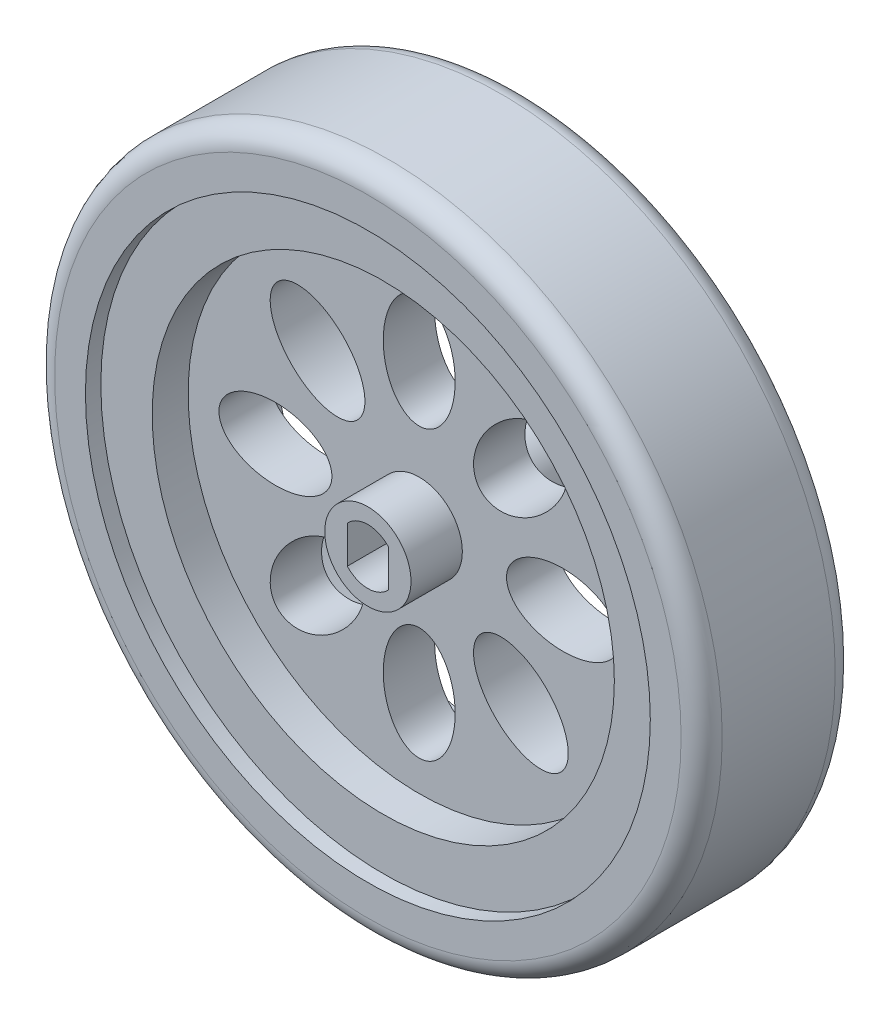
ISO-10303-21;
HEADER;
FILE_DESCRIPTION(('STEP AP214'),'2;1');
FILE_NAME('part.step','',(''),(''),'','','');
FILE_SCHEMA(('AUTOMOTIVE_DESIGN { 1 0 10303 214 1 1 1 1 }'));
ENDSEC;
DATA;
#1=APPLICATION_CONTEXT('core data for automotive mechanical design processes');
#2=APPLICATION_PROTOCOL_DEFINITION('international standard','automotive_design',2000,#1);
#3=PRODUCT_CONTEXT('',#1,'mechanical');
#4=PRODUCT('Part','Part','',(#3));
#5=PRODUCT_RELATED_PRODUCT_CATEGORY('part','',(#4));
#6=PRODUCT_DEFINITION_FORMATION('','',#4);
#7=PRODUCT_DEFINITION_CONTEXT('part definition',#1,'design');
#8=PRODUCT_DEFINITION('design','',#6,#7);
#9=PRODUCT_DEFINITION_SHAPE('','',#8);
#10=(LENGTH_UNIT() NAMED_UNIT(*) SI_UNIT(.MILLI.,.METRE.));
#11=(NAMED_UNIT(*) PLANE_ANGLE_UNIT() SI_UNIT($,.RADIAN.));
#12=(NAMED_UNIT(*) SI_UNIT($,.STERADIAN.) SOLID_ANGLE_UNIT());
#13=UNCERTAINTY_MEASURE_WITH_UNIT(LENGTH_MEASURE(1.E-05),#10,'distance_accuracy_value','');
#14=(GEOMETRIC_REPRESENTATION_CONTEXT(3) GLOBAL_UNCERTAINTY_ASSIGNED_CONTEXT((#13)) GLOBAL_UNIT_ASSIGNED_CONTEXT((#10,
#11,#12)) REPRESENTATION_CONTEXT('',''));
#15=CARTESIAN_POINT('',(0.,0.,0.));
#16=DIRECTION('',(0.,0.,1.));
#17=DIRECTION('',(1.,0.,0.));
#18=AXIS2_PLACEMENT_3D('',#15,#16,#17);
#19=CARTESIAN_POINT('',(0.,0.,-27.079393923934));
#20=DIRECTION('',(0.,0.,1.));
#21=DIRECTION('',(1.,0.,0.));
#22=AXIS2_PLACEMENT_3D('',#19,#20,#21);
#23=CYLINDRICAL_SURFACE('',#22,4.2);
#24=CARTESIAN_POINT('',(0.,0.,-11.35));
#25=DIRECTION('',(0.,0.,1.));
#26=DIRECTION('',(1.,0.,0.));
#27=AXIS2_PLACEMENT_3D('',#24,#25,#26);
#28=CIRCLE('',#27,4.2);
#29=CARTESIAN_POINT('',(4.2,0.,-11.35));
#30=VERTEX_POINT('',#29);
#31=EDGE_CURVE('E51',#30,#30,#28,.F.);
#32=ORIENTED_EDGE('',*,*,#31,.F.);
#33=EDGE_LOOP('',(#32));
#34=FACE_BOUND('',#33,.T.);
#35=CARTESIAN_POINT('',(0.,0.,-2.5));
#36=DIRECTION('',(0.,0.,1.));
#37=DIRECTION('',(1.,0.,0.));
#38=AXIS2_PLACEMENT_3D('',#35,#36,#37);
#39=CIRCLE('',#38,4.2);
#40=CARTESIAN_POINT('',(4.2,0.,-2.5));
#41=VERTEX_POINT('',#40);
#42=EDGE_CURVE('E142',#41,#41,#39,.T.);
#43=ORIENTED_EDGE('',*,*,#42,.F.);
#44=EDGE_LOOP('',(#43));
#45=FACE_BOUND('',#44,.T.);
#46=ADVANCED_FACE('F41',(#34,#45),#23,.T.);
#47=CARTESIAN_POINT('',(0.,0.,2.5));
#48=DIRECTION('',(0.,0.,1.));
#49=DIRECTION('',(1.,0.,0.));
#50=AXIS2_PLACEMENT_3D('',#47,#48,#49);
#51=CIRCLE('',#50,4.2);
#52=CARTESIAN_POINT('',(4.2,0.,2.5));
#53=VERTEX_POINT('',#52);
#54=EDGE_CURVE('E11',#53,#53,#51,.F.);
#55=ORIENTED_EDGE('',*,*,#54,.F.);
#56=EDGE_LOOP('',(#55));
#57=FACE_BOUND('',#56,.T.);
#58=CARTESIAN_POINT('',(0.,0.,7.5));
#59=DIRECTION('',(0.,0.,1.));
#60=DIRECTION('',(1.,0.,0.));
#61=AXIS2_PLACEMENT_3D('',#58,#59,#60);
#62=CIRCLE('',#61,4.2);
#63=CARTESIAN_POINT('',(4.2,0.,7.5));
#64=VERTEX_POINT('',#63);
#65=EDGE_CURVE('E116',#64,#64,#62,.T.);
#66=ORIENTED_EDGE('',*,*,#65,.F.);
#67=EDGE_LOOP('',(#66));
#68=FACE_BOUND('',#67,.T.);
#69=ADVANCED_FACE('F43',(#57,#68),#23,.T.);
#70=CARTESIAN_POINT('',(0.,0.,7.5));
#71=DIRECTION('',(0.,0.,1.));
#72=DIRECTION('',(1.,0.,0.));
#73=AXIS2_PLACEMENT_3D('',#70,#71,#72);
#74=PLANE('',#73);
#75=CARTESIAN_POINT('',(0.,0.,7.5));
#76=DIRECTION('',(0.,0.,1.));
#77=DIRECTION('',(1.,0.,0.));
#78=AXIS2_PLACEMENT_3D('',#75,#76,#77);
#79=CIRCLE('',#78,2.7);
#80=CARTESIAN_POINT('',(2.,1.81383571472171,7.5));
#81=VERTEX_POINT('',#80);
#82=CARTESIAN_POINT('',(-2.,1.81383571472171,7.5));
#83=VERTEX_POINT('',#82);
#84=EDGE_CURVE('E101',#81,#83,#79,.T.);
#85=ORIENTED_EDGE('',*,*,#84,.F.);
#86=DIRECTION('',(0.,1.,0.));
#87=VECTOR('',#86,1.);
#88=CARTESIAN_POINT('',(2.,1.81383571472171,7.5));
#89=LINE('',#88,#87);
#90=CARTESIAN_POINT('',(2.,-1.81383571472171,7.5));
#91=VERTEX_POINT('',#90);
#92=EDGE_CURVE('E106',#91,#81,#89,.T.);
#93=ORIENTED_EDGE('',*,*,#92,.F.);
#94=CARTESIAN_POINT('',(0.,0.,7.5));
#95=DIRECTION('',(0.,0.,1.));
#96=DIRECTION('',(1.,0.,0.));
#97=AXIS2_PLACEMENT_3D('',#94,#95,#96);
#98=CIRCLE('',#97,2.7);
#99=CARTESIAN_POINT('',(-2.,-1.81383571472171,7.5));
#100=VERTEX_POINT('',#99);
#101=EDGE_CURVE('E86',#100,#91,#98,.T.);
#102=ORIENTED_EDGE('',*,*,#101,.F.);
#103=DIRECTION('',(0.,-1.,0.));
#104=VECTOR('',#103,1.);
#105=CARTESIAN_POINT('',(-2.,1.81383571472171,7.5));
#106=LINE('',#105,#104);
#107=EDGE_CURVE('E94',#83,#100,#106,.T.);
#108=ORIENTED_EDGE('',*,*,#107,.F.);
#109=EDGE_LOOP('',(#85,#93,#102,#108));
#110=FACE_BOUND('',#109,.T.);
#111=ORIENTED_EDGE('',*,*,#65,.T.);
#112=EDGE_LOOP('',(#111));
#113=FACE_BOUND('',#112,.T.);
#114=ADVANCED_FACE('F103',(#110,#113),#74,.T.);
#115=CARTESIAN_POINT('',(-2.,1.81383571472171,-27.079393923934));
#116=DIRECTION('',(-1.,0.,0.));
#117=DIRECTION('',(0.,0.,1.));
#118=AXIS2_PLACEMENT_3D('',#115,#116,#117);
#119=PLANE('',#118);
#120=DIRECTION('',(0.,0.,1.));
#121=VECTOR('',#120,1.);
#122=CARTESIAN_POINT('',(-2.,-1.81383571472171,-27.079393923934));
#123=LINE('',#122,#121);
#124=CARTESIAN_POINT('',(-2.,-1.81383571472171,-11.35));
#125=VERTEX_POINT('',#124);
#126=EDGE_CURVE('E82',#125,#100,#123,.T.);
#127=ORIENTED_EDGE('',*,*,#126,.F.);
#128=DIRECTION('',(0.,1.,0.));
#129=VECTOR('',#128,1.);
#130=CARTESIAN_POINT('',(-2.,1.81383571472171,-11.35));
#131=LINE('',#130,#129);
#132=CARTESIAN_POINT('',(-2.,1.81383571472171,-11.35));
#133=VERTEX_POINT('',#132);
#134=EDGE_CURVE('E58',#125,#133,#131,.T.);
#135=ORIENTED_EDGE('',*,*,#134,.T.);
#136=DIRECTION('',(0.,0.,1.));
#137=VECTOR('',#136,1.);
#138=CARTESIAN_POINT('',(-2.,1.81383571472171,-27.079393923934));
#139=LINE('',#138,#137);
#140=EDGE_CURVE('E91',#133,#83,#139,.T.);
#141=ORIENTED_EDGE('',*,*,#140,.T.);
#142=ORIENTED_EDGE('',*,*,#107,.T.);
#143=EDGE_LOOP('',(#127,#135,#141,#142));
#144=FACE_BOUND('',#143,.T.);
#145=ADVANCED_FACE('F95',(#144),#119,.F.);
#146=CARTESIAN_POINT('',(0.,0.,-27.079393923934));
#147=DIRECTION('',(0.,0.,1.));
#148=DIRECTION('',(1.,0.,0.));
#149=AXIS2_PLACEMENT_3D('',#146,#147,#148);
#150=CYLINDRICAL_SURFACE('',#149,2.7);
#151=DIRECTION('',(0.,0.,1.));
#152=VECTOR('',#151,1.);
#153=CARTESIAN_POINT('',(2.,-1.81383571472171,-27.079393923934));
#154=LINE('',#153,#152);
#155=CARTESIAN_POINT('',(2.,-1.81383571472171,-11.35));
#156=VERTEX_POINT('',#155);
#157=EDGE_CURVE('E90',#156,#91,#154,.T.);
#158=ORIENTED_EDGE('',*,*,#157,.F.);
#159=CARTESIAN_POINT('',(0.,0.,-11.35));
#160=DIRECTION('',(0.,0.,1.));
#161=DIRECTION('',(1.,0.,0.));
#162=AXIS2_PLACEMENT_3D('',#159,#160,#161);
#163=CIRCLE('',#162,2.7);
#164=EDGE_CURVE('E62',#156,#125,#163,.F.);
#165=ORIENTED_EDGE('',*,*,#164,.T.);
#166=ORIENTED_EDGE('',*,*,#126,.T.);
#167=ORIENTED_EDGE('',*,*,#101,.T.);
#168=EDGE_LOOP('',(#158,#165,#166,#167));
#169=FACE_BOUND('',#168,.T.);
#170=ADVANCED_FACE('F84',(#169),#150,.F.);
#171=CARTESIAN_POINT('',(2.,1.81383571472171,-27.079393923934));
#172=DIRECTION('',(1.,0.,0.));
#173=DIRECTION('',(0.,0.,-1.));
#174=AXIS2_PLACEMENT_3D('',#171,#172,#173);
#175=PLANE('',#174);
#176=DIRECTION('',(0.,0.,1.));
#177=VECTOR('',#176,1.);
#178=CARTESIAN_POINT('',(2.,1.81383571472171,-27.079393923934));
#179=LINE('',#178,#177);
#180=CARTESIAN_POINT('',(2.,1.81383571472171,-11.35));
#181=VERTEX_POINT('',#180);
#182=EDGE_CURVE('E113',#181,#81,#179,.T.);
#183=ORIENTED_EDGE('',*,*,#182,.F.);
#184=DIRECTION('',(0.,-1.,0.));
#185=VECTOR('',#184,1.);
#186=CARTESIAN_POINT('',(2.,1.81383571472171,-11.35));
#187=LINE('',#186,#185);
#188=EDGE_CURVE('E128',#181,#156,#187,.T.);
#189=ORIENTED_EDGE('',*,*,#188,.T.);
#190=ORIENTED_EDGE('',*,*,#157,.T.);
#191=ORIENTED_EDGE('',*,*,#92,.T.);
#192=EDGE_LOOP('',(#183,#189,#190,#191));
#193=FACE_BOUND('',#192,.T.);
#194=ADVANCED_FACE('F263',(#193),#175,.F.);
#195=CARTESIAN_POINT('',(0.,0.,-27.079393923934));
#196=DIRECTION('',(0.,0.,1.));
#197=DIRECTION('',(1.,0.,0.));
#198=AXIS2_PLACEMENT_3D('',#195,#196,#197);
#199=CYLINDRICAL_SURFACE('',#198,2.7);
#200=ORIENTED_EDGE('',*,*,#140,.F.);
#201=CARTESIAN_POINT('',(0.,0.,-11.35));
#202=DIRECTION('',(0.,0.,1.));
#203=DIRECTION('',(1.,0.,0.));
#204=AXIS2_PLACEMENT_3D('',#201,#202,#203);
#205=CIRCLE('',#204,2.7);
#206=EDGE_CURVE('E125',#133,#181,#205,.F.);
#207=ORIENTED_EDGE('',*,*,#206,.T.);
#208=ORIENTED_EDGE('',*,*,#182,.T.);
#209=ORIENTED_EDGE('',*,*,#84,.T.);
#210=EDGE_LOOP('',(#200,#207,#208,#209));
#211=FACE_BOUND('',#210,.T.);
#212=ADVANCED_FACE('F261',(#211),#199,.F.);
#213=CARTESIAN_POINT('',(0.,0.,-11.35));
#214=DIRECTION('',(0.,0.,1.));
#215=DIRECTION('',(1.,0.,0.));
#216=AXIS2_PLACEMENT_3D('',#213,#214,#215);
#217=PLANE('',#216);
#218=ORIENTED_EDGE('',*,*,#31,.T.);
#219=EDGE_LOOP('',(#218));
#220=FACE_BOUND('',#219,.T.);
#221=ORIENTED_EDGE('',*,*,#134,.F.);
#222=ORIENTED_EDGE('',*,*,#164,.F.);
#223=ORIENTED_EDGE('',*,*,#188,.F.);
#224=ORIENTED_EDGE('',*,*,#206,.F.);
#225=EDGE_LOOP('',(#221,#222,#223,#224));
#226=FACE_BOUND('',#225,.T.);
#227=ADVANCED_FACE('F254',(#220,#226),#217,.F.);
#228=CARTESIAN_POINT('',(0.,0.,2.5));
#229=DIRECTION('',(0.,0.,1.));
#230=DIRECTION('',(1.,0.,0.));
#231=AXIS2_PLACEMENT_3D('',#228,#229,#230);
#232=PLANE('',#231);
#233=CARTESIAN_POINT('',(-14.,0.,2.5));
#234=DIRECTION('',(0.,0.,1.));
#235=DIRECTION('',(-1.,0.,0.));
#236=AXIS2_PLACEMENT_3D('',#233,#234,#235);
#237=ELLIPSE('',#236,5.5,3.5);
#238=CARTESIAN_POINT('',(-19.5,0.,2.5));
#239=VERTEX_POINT('',#238);
#240=EDGE_CURVE('E474',#239,#239,#237,.T.);
#241=ORIENTED_EDGE('',*,*,#240,.F.);
#242=EDGE_LOOP('',(#241));
#243=FACE_BOUND('',#242,.T.);
#244=CARTESIAN_POINT('',(-9.89949493661161,-9.89949493661172,2.5));
#245=DIRECTION('',(0.,0.,1.));
#246=DIRECTION('',(-0.707106781186544,-0.707106781186551,0.));
#247=AXIS2_PLACEMENT_3D('',#244,#245,#246);
#248=ELLIPSE('',#247,5.5,3.5);
#249=CARTESIAN_POINT('',(-13.7885822331376,-13.7885822331378,2.5));
#250=VERTEX_POINT('',#249);
#251=EDGE_CURVE('E484',#250,#250,#248,.T.);
#252=ORIENTED_EDGE('',*,*,#251,.F.);
#253=EDGE_LOOP('',(#252));
#254=FACE_BOUND('',#253,.T.);
#255=CARTESIAN_POINT('',(0.,-14.,2.5));
#256=DIRECTION('',(0.,0.,1.));
#257=DIRECTION('',(0.,-1.,0.));
#258=AXIS2_PLACEMENT_3D('',#255,#256,#257);
#259=ELLIPSE('',#258,5.5,3.5);
#260=CARTESIAN_POINT('',(0.,-19.5,2.5));
#261=VERTEX_POINT('',#260);
#262=EDGE_CURVE('E494',#261,#261,#259,.T.);
#263=ORIENTED_EDGE('',*,*,#262,.F.);
#264=EDGE_LOOP('',(#263));
#265=FACE_BOUND('',#264,.T.);
#266=CARTESIAN_POINT('',(9.89949493661175,-9.89949493661158,2.5));
#267=DIRECTION('',(0.,0.,1.));
#268=DIRECTION('',(0.707106781186554,-0.707106781186541,0.));
#269=AXIS2_PLACEMENT_3D('',#266,#267,#268);
#270=ELLIPSE('',#269,5.5,3.5);
#271=CARTESIAN_POINT('',(13.7885822331378,-13.7885822331376,2.5));
#272=VERTEX_POINT('',#271);
#273=EDGE_CURVE('E499',#272,#272,#270,.T.);
#274=ORIENTED_EDGE('',*,*,#273,.F.);
#275=EDGE_LOOP('',(#274));
#276=FACE_BOUND('',#275,.T.);
#277=CARTESIAN_POINT('',(14.,1.46642216231412E-13,2.5));
#278=DIRECTION('',(0.,0.,1.));
#279=DIRECTION('',(1.,0.,0.));
#280=AXIS2_PLACEMENT_3D('',#277,#278,#279);
#281=ELLIPSE('',#280,5.5,3.5);
#282=CARTESIAN_POINT('',(19.5,2.04251658322323E-13,2.5));
#283=VERTEX_POINT('',#282);
#284=EDGE_CURVE('E541',#283,#283,#281,.T.);
#285=ORIENTED_EDGE('',*,*,#284,.F.);
#286=EDGE_LOOP('',(#285));
#287=FACE_BOUND('',#286,.T.);
#288=CARTESIAN_POINT('',(9.89949493661154,9.89949493661179,2.5));
#289=DIRECTION('',(0.,0.,1.));
#290=DIRECTION('',(0.707106781186539,0.707106781186556,0.));
#291=AXIS2_PLACEMENT_3D('',#288,#289,#290);
#292=ELLIPSE('',#291,5.5,3.5);
#293=CARTESIAN_POINT('',(13.7885822331375,13.7885822331378,2.5));
#294=VERTEX_POINT('',#293);
#295=EDGE_CURVE('E548',#294,#294,#292,.T.);
#296=ORIENTED_EDGE('',*,*,#295,.F.);
#297=EDGE_LOOP('',(#296));
#298=FACE_BOUND('',#297,.T.);
#299=CARTESIAN_POINT('',(-9.89949493661168,9.89949493661165,2.5));
#300=DIRECTION('',(0.,0.,1.));
#301=DIRECTION('',(-0.707106781186549,0.707106781186546,0.));
#302=AXIS2_PLACEMENT_3D('',#299,#300,#301);
#303=ELLIPSE('',#302,5.5,3.5);
#304=CARTESIAN_POINT('',(-13.7885822331377,13.7885822331377,2.5));
#305=VERTEX_POINT('',#304);
#306=EDGE_CURVE('E481',#305,#305,#303,.T.);
#307=ORIENTED_EDGE('',*,*,#306,.F.);
#308=EDGE_LOOP('',(#307));
#309=FACE_BOUND('',#308,.T.);
#310=CARTESIAN_POINT('',(0.,14.,2.5));
#311=DIRECTION('',(0.,0.,1.));
#312=DIRECTION('',(0.,1.,0.));
#313=AXIS2_PLACEMENT_3D('',#310,#311,#312);
#314=ELLIPSE('',#313,5.5,3.5);
#315=CARTESIAN_POINT('',(0.,19.5,2.5));
#316=VERTEX_POINT('',#315);
#317=EDGE_CURVE('E192',#316,#316,#314,.T.);
#318=ORIENTED_EDGE('',*,*,#317,.F.);
#319=EDGE_LOOP('',(#318));
#320=FACE_BOUND('',#319,.T.);
#321=CARTESIAN_POINT('',(0.,0.,2.5));
#322=DIRECTION('',(0.,0.,1.));
#323=DIRECTION('',(1.,0.,0.));
#324=AXIS2_PLACEMENT_3D('',#321,#322,#323);
#325=CIRCLE('',#324,22.5);
#326=CARTESIAN_POINT('',(22.5,0.,2.5));
#327=VERTEX_POINT('',#326);
#328=EDGE_CURVE('E148',#327,#327,#325,.F.);
#329=ORIENTED_EDGE('',*,*,#328,.F.);
#330=EDGE_LOOP('',(#329));
#331=FACE_BOUND('',#330,.T.);
#332=ORIENTED_EDGE('',*,*,#54,.T.);
#333=EDGE_LOOP('',(#332));
#334=FACE_BOUND('',#333,.T.);
#335=ADVANCED_FACE('F250',(#243,#254,#265,#276,#287,#298,#309,#320,#331,#334),#232,.T.);
#336=CARTESIAN_POINT('',(0.,0.,-2.5));
#337=DIRECTION('',(0.,0.,1.));
#338=DIRECTION('',(1.,0.,0.));
#339=AXIS2_PLACEMENT_3D('',#336,#337,#338);
#340=PLANE('',#339);
#341=CARTESIAN_POINT('',(-14.,0.,-2.5));
#342=DIRECTION('',(0.,0.,1.));
#343=DIRECTION('',(-1.,0.,0.));
#344=AXIS2_PLACEMENT_3D('',#341,#342,#343);
#345=ELLIPSE('',#344,5.5,3.5);
#346=CARTESIAN_POINT('',(-19.5,0.,-2.5));
#347=VERTEX_POINT('',#346);
#348=EDGE_CURVE('E477',#347,#347,#345,.T.);
#349=ORIENTED_EDGE('',*,*,#348,.T.);
#350=EDGE_LOOP('',(#349));
#351=FACE_BOUND('',#350,.T.);
#352=CARTESIAN_POINT('',(-9.89949493661161,-9.89949493661172,-2.5));
#353=DIRECTION('',(0.,0.,1.));
#354=DIRECTION('',(-0.707106781186544,-0.707106781186551,0.));
#355=AXIS2_PLACEMENT_3D('',#352,#353,#354);
#356=ELLIPSE('',#355,5.5,3.5);
#357=CARTESIAN_POINT('',(-13.7885822331376,-13.7885822331378,-2.5));
#358=VERTEX_POINT('',#357);
#359=EDGE_CURVE('E478',#358,#358,#356,.T.);
#360=ORIENTED_EDGE('',*,*,#359,.T.);
#361=EDGE_LOOP('',(#360));
#362=FACE_BOUND('',#361,.T.);
#363=CARTESIAN_POINT('',(0.,-14.,-2.5));
#364=DIRECTION('',(0.,0.,1.));
#365=DIRECTION('',(0.,-1.,0.));
#366=AXIS2_PLACEMENT_3D('',#363,#364,#365);
#367=ELLIPSE('',#366,5.5,3.5);
#368=CARTESIAN_POINT('',(0.,-19.5,-2.5));
#369=VERTEX_POINT('',#368);
#370=EDGE_CURVE('E488',#369,#369,#367,.T.);
#371=ORIENTED_EDGE('',*,*,#370,.T.);
#372=EDGE_LOOP('',(#371));
#373=FACE_BOUND('',#372,.T.);
#374=CARTESIAN_POINT('',(9.89949493661175,-9.89949493661158,-2.5));
#375=DIRECTION('',(0.,0.,1.));
#376=DIRECTION('',(0.707106781186554,-0.707106781186541,0.));
#377=AXIS2_PLACEMENT_3D('',#374,#375,#376);
#378=ELLIPSE('',#377,5.5,3.5);
#379=CARTESIAN_POINT('',(13.7885822331378,-13.7885822331376,-2.5));
#380=VERTEX_POINT('',#379);
#381=EDGE_CURVE('E503',#380,#380,#378,.T.);
#382=ORIENTED_EDGE('',*,*,#381,.T.);
#383=EDGE_LOOP('',(#382));
#384=FACE_BOUND('',#383,.T.);
#385=CARTESIAN_POINT('',(14.,1.46642216231412E-13,-2.5));
#386=DIRECTION('',(0.,0.,1.));
#387=DIRECTION('',(1.,0.,0.));
#388=AXIS2_PLACEMENT_3D('',#385,#386,#387);
#389=ELLIPSE('',#388,5.5,3.5);
#390=CARTESIAN_POINT('',(19.5,2.04251658322323E-13,-2.5));
#391=VERTEX_POINT('',#390);
#392=EDGE_CURVE('E504',#391,#391,#389,.T.);
#393=ORIENTED_EDGE('',*,*,#392,.T.);
#394=EDGE_LOOP('',(#393));
#395=FACE_BOUND('',#394,.T.);
#396=CARTESIAN_POINT('',(9.89949493661154,9.89949493661179,-2.5));
#397=DIRECTION('',(0.,0.,1.));
#398=DIRECTION('',(0.707106781186539,0.707106781186556,0.));
#399=AXIS2_PLACEMENT_3D('',#396,#397,#398);
#400=ELLIPSE('',#399,5.5,3.5);
#401=CARTESIAN_POINT('',(13.7885822331375,13.7885822331378,-2.5));
#402=VERTEX_POINT('',#401);
#403=EDGE_CURVE('E472',#402,#402,#400,.T.);
#404=ORIENTED_EDGE('',*,*,#403,.T.);
#405=EDGE_LOOP('',(#404));
#406=FACE_BOUND('',#405,.T.);
#407=CARTESIAN_POINT('',(-9.89949493661168,9.89949493661165,-2.5));
#408=DIRECTION('',(0.,0.,1.));
#409=DIRECTION('',(-0.707106781186549,0.707106781186546,0.));
#410=AXIS2_PLACEMENT_3D('',#407,#408,#409);
#411=ELLIPSE('',#410,5.5,3.5);
#412=CARTESIAN_POINT('',(-13.7885822331377,13.7885822331377,-2.5));
#413=VERTEX_POINT('',#412);
#414=EDGE_CURVE('E201',#413,#413,#411,.T.);
#415=ORIENTED_EDGE('',*,*,#414,.T.);
#416=EDGE_LOOP('',(#415));
#417=FACE_BOUND('',#416,.T.);
#418=CARTESIAN_POINT('',(0.,14.,-2.5));
#419=DIRECTION('',(0.,0.,1.));
#420=DIRECTION('',(0.,1.,0.));
#421=AXIS2_PLACEMENT_3D('',#418,#419,#420);
#422=ELLIPSE('',#421,5.5,3.5);
#423=CARTESIAN_POINT('',(0.,19.5,-2.5));
#424=VERTEX_POINT('',#423);
#425=EDGE_CURVE('E45',#424,#424,#422,.T.);
#426=ORIENTED_EDGE('',*,*,#425,.T.);
#427=EDGE_LOOP('',(#426));
#428=FACE_BOUND('',#427,.T.);
#429=CARTESIAN_POINT('',(0.,0.,-2.5));
#430=DIRECTION('',(0.,0.,1.));
#431=DIRECTION('',(1.,0.,0.));
#432=AXIS2_PLACEMENT_3D('',#429,#430,#431);
#433=CIRCLE('',#432,22.5);
#434=CARTESIAN_POINT('',(22.5,0.,-2.5));
#435=VERTEX_POINT('',#434);
#436=EDGE_CURVE('E139',#435,#435,#433,.T.);
#437=ORIENTED_EDGE('',*,*,#436,.F.);
#438=EDGE_LOOP('',(#437));
#439=FACE_BOUND('',#438,.T.);
#440=ORIENTED_EDGE('',*,*,#42,.T.);
#441=EDGE_LOOP('',(#440));
#442=FACE_BOUND('',#441,.T.);
#443=ADVANCED_FACE('F253',(#351,#362,#373,#384,#395,#406,#417,#428,#439,#442),#340,.F.);
#444=CARTESIAN_POINT('',(0.,0.,6.));
#445=DIRECTION('',(0.,0.,-1.));
#446=DIRECTION('',(-1.,0.,0.));
#447=AXIS2_PLACEMENT_3D('',#444,#445,#446);
#448=CYLINDRICAL_SURFACE('',#447,22.5);
#449=CARTESIAN_POINT('',(0.,0.,-6.));
#450=DIRECTION('',(0.,0.,1.));
#451=DIRECTION('',(1.,0.,0.));
#452=AXIS2_PLACEMENT_3D('',#449,#450,#451);
#453=CIRCLE('',#452,22.5);
#454=CARTESIAN_POINT('',(22.5,0.,-6.));
#455=VERTEX_POINT('',#454);
#456=EDGE_CURVE('E188',#455,#455,#453,.T.);
#457=ORIENTED_EDGE('',*,*,#456,.F.);
#458=EDGE_LOOP('',(#457));
#459=FACE_BOUND('',#458,.T.);
#460=ORIENTED_EDGE('',*,*,#436,.T.);
#461=EDGE_LOOP('',(#460));
#462=FACE_BOUND('',#461,.T.);
#463=ADVANCED_FACE('F217',(#459,#462),#448,.F.);
#464=CARTESIAN_POINT('',(0.,0.,7.5));
#465=DIRECTION('',(0.,0.,-1.));
#466=DIRECTION('',(-1.,0.,0.));
#467=AXIS2_PLACEMENT_3D('',#464,#465,#466);
#468=CYLINDRICAL_SURFACE('',#467,27.5);
#469=CARTESIAN_POINT('',(0.,0.,-7.5));
#470=DIRECTION('',(0.,0.,1.));
#471=DIRECTION('',(1.,0.,0.));
#472=AXIS2_PLACEMENT_3D('',#469,#470,#471);
#473=CIRCLE('',#472,27.5);
#474=CARTESIAN_POINT('',(27.5,0.,-7.5));
#475=VERTEX_POINT('',#474);
#476=EDGE_CURVE('E176',#475,#475,#473,.T.);
#477=ORIENTED_EDGE('',*,*,#476,.F.);
#478=EDGE_LOOP('',(#477));
#479=FACE_BOUND('',#478,.T.);
#480=CARTESIAN_POINT('',(0.,0.,-6.));
#481=DIRECTION('',(0.,0.,1.));
#482=DIRECTION('',(1.,0.,0.));
#483=AXIS2_PLACEMENT_3D('',#480,#481,#482);
#484=CIRCLE('',#483,27.5);
#485=CARTESIAN_POINT('',(27.5,0.,-6.));
#486=VERTEX_POINT('',#485);
#487=EDGE_CURVE('E180',#486,#486,#484,.T.);
#488=ORIENTED_EDGE('',*,*,#487,.T.);
#489=EDGE_LOOP('',(#488));
#490=FACE_BOUND('',#489,.T.);
#491=ADVANCED_FACE('F232',(#479,#490),#468,.F.);
#492=CARTESIAN_POINT('',(0.,0.,7.5));
#493=DIRECTION('',(0.,0.,1.));
#494=DIRECTION('',(1.,0.,0.));
#495=AXIS2_PLACEMENT_3D('',#492,#493,#494);
#496=PLANE('',#495);
#497=CARTESIAN_POINT('',(0.,0.,7.5));
#498=DIRECTION('',(0.,0.,1.));
#499=DIRECTION('',(1.,0.,0.));
#500=AXIS2_PLACEMENT_3D('',#497,#498,#499);
#501=CIRCLE('',#500,30.5);
#502=CARTESIAN_POINT('',(30.5,0.,7.5));
#503=VERTEX_POINT('',#502);
#504=EDGE_CURVE('E159',#503,#503,#501,.T.);
#505=ORIENTED_EDGE('',*,*,#504,.T.);
#506=EDGE_LOOP('',(#505));
#507=FACE_BOUND('',#506,.T.);
#508=CARTESIAN_POINT('',(0.,0.,7.5));
#509=DIRECTION('',(0.,0.,1.));
#510=DIRECTION('',(1.,0.,0.));
#511=AXIS2_PLACEMENT_3D('',#508,#509,#510);
#512=CIRCLE('',#511,27.5);
#513=CARTESIAN_POINT('',(27.5,0.,7.5));
#514=VERTEX_POINT('',#513);
#515=EDGE_CURVE('E175',#514,#514,#512,.T.);
#516=ORIENTED_EDGE('',*,*,#515,.F.);
#517=EDGE_LOOP('',(#516));
#518=FACE_BOUND('',#517,.T.);
#519=ADVANCED_FACE('F233',(#507,#518),#496,.T.);
#520=CARTESIAN_POINT('',(0.,0.,-7.5));
#521=DIRECTION('',(0.,0.,1.));
#522=DIRECTION('',(1.,0.,0.));
#523=AXIS2_PLACEMENT_3D('',#520,#521,#522);
#524=PLANE('',#523);
#525=CARTESIAN_POINT('',(0.,0.,-7.5));
#526=DIRECTION('',(0.,0.,1.));
#527=DIRECTION('',(1.,0.,0.));
#528=AXIS2_PLACEMENT_3D('',#525,#526,#527);
#529=CIRCLE('',#528,30.5);
#530=CARTESIAN_POINT('',(30.5,0.,-7.5));
#531=VERTEX_POINT('',#530);
#532=EDGE_CURVE('E163',#531,#531,#529,.F.);
#533=ORIENTED_EDGE('',*,*,#532,.T.);
#534=EDGE_LOOP('',(#533));
#535=FACE_BOUND('',#534,.T.);
#536=ORIENTED_EDGE('',*,*,#476,.T.);
#537=EDGE_LOOP('',(#536));
#538=FACE_BOUND('',#537,.T.);
#539=ADVANCED_FACE('F236',(#535,#538),#524,.F.);
#540=CARTESIAN_POINT('',(0.,0.,7.5));
#541=DIRECTION('',(0.,0.,-1.));
#542=DIRECTION('',(-1.,0.,0.));
#543=AXIS2_PLACEMENT_3D('',#540,#541,#542);
#544=CYLINDRICAL_SURFACE('',#543,32.5);
#545=CARTESIAN_POINT('',(0.,0.,-5.5));
#546=DIRECTION('',(0.,0.,1.));
#547=DIRECTION('',(1.,0.,0.));
#548=AXIS2_PLACEMENT_3D('',#545,#546,#547);
#549=CIRCLE('',#548,32.5);
#550=CARTESIAN_POINT('',(32.5,0.,-5.5));
#551=VERTEX_POINT('',#550);
#552=EDGE_CURVE('E167',#551,#551,#549,.T.);
#553=ORIENTED_EDGE('',*,*,#552,.T.);
#554=EDGE_LOOP('',(#553));
#555=FACE_BOUND('',#554,.T.);
#556=CARTESIAN_POINT('',(0.,0.,5.5));
#557=DIRECTION('',(0.,0.,1.));
#558=DIRECTION('',(1.,0.,0.));
#559=AXIS2_PLACEMENT_3D('',#556,#557,#558);
#560=CIRCLE('',#559,32.5);
#561=CARTESIAN_POINT('',(32.5,0.,5.5));
#562=VERTEX_POINT('',#561);
#563=EDGE_CURVE('E171',#562,#562,#560,.F.);
#564=ORIENTED_EDGE('',*,*,#563,.T.);
#565=EDGE_LOOP('',(#564));
#566=FACE_BOUND('',#565,.T.);
#567=ADVANCED_FACE('F230',(#555,#566),#544,.T.);
#568=CARTESIAN_POINT('',(0.,0.,6.));
#569=DIRECTION('',(0.,0.,1.));
#570=DIRECTION('',(1.,0.,0.));
#571=AXIS2_PLACEMENT_3D('',#568,#569,#570);
#572=CIRCLE('',#571,27.5);
#573=CARTESIAN_POINT('',(27.5,0.,6.));
#574=VERTEX_POINT('',#573);
#575=EDGE_CURVE('E155',#574,#574,#572,.T.);
#576=ORIENTED_EDGE('',*,*,#575,.F.);
#577=EDGE_LOOP('',(#576));
#578=FACE_BOUND('',#577,.T.);
#579=ORIENTED_EDGE('',*,*,#515,.T.);
#580=EDGE_LOOP('',(#579));
#581=FACE_BOUND('',#580,.T.);
#582=ADVANCED_FACE('F226',(#578,#581),#468,.F.);
#583=CARTESIAN_POINT('',(0.,0.,-5.5));
#584=DIRECTION('',(0.,0.,1.));
#585=DIRECTION('',(1.,0.,0.));
#586=AXIS2_PLACEMENT_3D('',#583,#584,#585);
#587=TOROIDAL_SURFACE('',#586,30.5,2.);
#588=ORIENTED_EDGE('',*,*,#532,.F.);
#589=EDGE_LOOP('',(#588));
#590=FACE_BOUND('',#589,.T.);
#591=ORIENTED_EDGE('',*,*,#552,.F.);
#592=EDGE_LOOP('',(#591));
#593=FACE_BOUND('',#592,.T.);
#594=ADVANCED_FACE('F229',(#590,#593),#587,.T.);
#595=CARTESIAN_POINT('',(0.,0.,5.5));
#596=DIRECTION('',(0.,0.,1.));
#597=DIRECTION('',(1.,0.,0.));
#598=AXIS2_PLACEMENT_3D('',#595,#596,#597);
#599=TOROIDAL_SURFACE('',#598,30.5,2.);
#600=ORIENTED_EDGE('',*,*,#563,.F.);
#601=EDGE_LOOP('',(#600));
#602=FACE_BOUND('',#601,.T.);
#603=ORIENTED_EDGE('',*,*,#504,.F.);
#604=EDGE_LOOP('',(#603));
#605=FACE_BOUND('',#604,.T.);
#606=ADVANCED_FACE('F221',(#602,#605),#599,.T.);
#607=CARTESIAN_POINT('',(0.,0.,6.));
#608=DIRECTION('',(0.,0.,1.));
#609=DIRECTION('',(1.,0.,0.));
#610=AXIS2_PLACEMENT_3D('',#607,#608,#609);
#611=PLANE('',#610);
#612=ORIENTED_EDGE('',*,*,#575,.T.);
#613=EDGE_LOOP('',(#612));
#614=FACE_BOUND('',#613,.T.);
#615=CARTESIAN_POINT('',(0.,0.,6.));
#616=DIRECTION('',(0.,0.,1.));
#617=DIRECTION('',(1.,0.,0.));
#618=AXIS2_PLACEMENT_3D('',#615,#616,#617);
#619=CIRCLE('',#618,22.5);
#620=CARTESIAN_POINT('',(22.5,0.,6.));
#621=VERTEX_POINT('',#620);
#622=EDGE_CURVE('E187',#621,#621,#619,.T.);
#623=ORIENTED_EDGE('',*,*,#622,.F.);
#624=EDGE_LOOP('',(#623));
#625=FACE_BOUND('',#624,.T.);
#626=ADVANCED_FACE('F218',(#614,#625),#611,.T.);
#627=CARTESIAN_POINT('',(0.,0.,-6.));
#628=DIRECTION('',(0.,0.,1.));
#629=DIRECTION('',(1.,0.,0.));
#630=AXIS2_PLACEMENT_3D('',#627,#628,#629);
#631=PLANE('',#630);
#632=ORIENTED_EDGE('',*,*,#487,.F.);
#633=EDGE_LOOP('',(#632));
#634=FACE_BOUND('',#633,.T.);
#635=ORIENTED_EDGE('',*,*,#456,.T.);
#636=EDGE_LOOP('',(#635));
#637=FACE_BOUND('',#636,.T.);
#638=ADVANCED_FACE('F215',(#634,#637),#631,.F.);
#639=ORIENTED_EDGE('',*,*,#328,.T.);
#640=EDGE_LOOP('',(#639));
#641=FACE_BOUND('',#640,.T.);
#642=ORIENTED_EDGE('',*,*,#622,.T.);
#643=EDGE_LOOP('',(#642));
#644=FACE_BOUND('',#643,.T.);
#645=ADVANCED_FACE('F209',(#641,#644),#448,.F.);
#646=CARTESIAN_POINT('',(0.,14.,-11.35));
#647=DIRECTION('',(0.,0.,1.));
#648=DIRECTION('',(0.,1.,0.));
#649=AXIS2_PLACEMENT_3D('',#646,#647,#648);
#650=ELLIPSE('',#649,5.5,3.5);
#651=DIRECTION('',(0.,0.,1.));
#652=VECTOR('',#651,1.);
#653=SURFACE_OF_LINEAR_EXTRUSION('',#650,#652);
#654=ORIENTED_EDGE('',*,*,#317,.T.);
#655=EDGE_LOOP('',(#654));
#656=FACE_BOUND('',#655,.T.);
#657=ORIENTED_EDGE('',*,*,#425,.F.);
#658=EDGE_LOOP('',(#657));
#659=FACE_BOUND('',#658,.T.);
#660=ADVANCED_FACE('F204',(#656,#659),#653,.F.);
#661=CARTESIAN_POINT('',(-9.89949493661168,9.89949493661165,-11.35));
#662=DIRECTION('',(0.,0.,1.));
#663=DIRECTION('',(-0.707106781186549,0.707106781186546,0.));
#664=AXIS2_PLACEMENT_3D('',#661,#662,#663);
#665=ELLIPSE('',#664,5.5,3.5);
#666=DIRECTION('',(0.,0.,1.));
#667=VECTOR('',#666,1.);
#668=SURFACE_OF_LINEAR_EXTRUSION('',#665,#667);
#669=ORIENTED_EDGE('',*,*,#306,.T.);
#670=EDGE_LOOP('',(#669));
#671=FACE_BOUND('',#670,.T.);
#672=ORIENTED_EDGE('',*,*,#414,.F.);
#673=EDGE_LOOP('',(#672));
#674=FACE_BOUND('',#673,.T.);
#675=ADVANCED_FACE('F208',(#671,#674),#668,.F.);
#676=CARTESIAN_POINT('',(9.89949493661154,9.89949493661179,-11.35));
#677=DIRECTION('',(0.,0.,1.));
#678=DIRECTION('',(0.707106781186539,0.707106781186556,0.));
#679=AXIS2_PLACEMENT_3D('',#676,#677,#678);
#680=ELLIPSE('',#679,5.5,3.5);
#681=DIRECTION('',(0.,0.,1.));
#682=VECTOR('',#681,1.);
#683=SURFACE_OF_LINEAR_EXTRUSION('',#680,#682);
#684=ORIENTED_EDGE('',*,*,#295,.T.);
#685=EDGE_LOOP('',(#684));
#686=FACE_BOUND('',#685,.T.);
#687=ORIENTED_EDGE('',*,*,#403,.F.);
#688=EDGE_LOOP('',(#687));
#689=FACE_BOUND('',#688,.T.);
#690=ADVANCED_FACE('F389',(#686,#689),#683,.F.);
#691=CARTESIAN_POINT('',(14.,1.46642216231412E-13,-11.35));
#692=DIRECTION('',(0.,0.,1.));
#693=DIRECTION('',(1.,0.,0.));
#694=AXIS2_PLACEMENT_3D('',#691,#692,#693);
#695=ELLIPSE('',#694,5.5,3.5);
#696=DIRECTION('',(0.,0.,1.));
#697=VECTOR('',#696,1.);
#698=SURFACE_OF_LINEAR_EXTRUSION('',#695,#697);
#699=ORIENTED_EDGE('',*,*,#284,.T.);
#700=EDGE_LOOP('',(#699));
#701=FACE_BOUND('',#700,.T.);
#702=ORIENTED_EDGE('',*,*,#392,.F.);
#703=EDGE_LOOP('',(#702));
#704=FACE_BOUND('',#703,.T.);
#705=ADVANCED_FACE('F400',(#701,#704),#698,.F.);
#706=CARTESIAN_POINT('',(9.89949493661175,-9.89949493661158,-11.35));
#707=DIRECTION('',(0.,0.,1.));
#708=DIRECTION('',(0.707106781186554,-0.707106781186541,0.));
#709=AXIS2_PLACEMENT_3D('',#706,#707,#708);
#710=ELLIPSE('',#709,5.5,3.5);
#711=DIRECTION('',(0.,0.,1.));
#712=VECTOR('',#711,1.);
#713=SURFACE_OF_LINEAR_EXTRUSION('',#710,#712);
#714=ORIENTED_EDGE('',*,*,#273,.T.);
#715=EDGE_LOOP('',(#714));
#716=FACE_BOUND('',#715,.T.);
#717=ORIENTED_EDGE('',*,*,#381,.F.);
#718=EDGE_LOOP('',(#717));
#719=FACE_BOUND('',#718,.T.);
#720=ADVANCED_FACE('F411',(#716,#719),#713,.F.);
#721=CARTESIAN_POINT('',(0.,-14.,-11.35));
#722=DIRECTION('',(0.,0.,1.));
#723=DIRECTION('',(0.,-1.,0.));
#724=AXIS2_PLACEMENT_3D('',#721,#722,#723);
#725=ELLIPSE('',#724,5.5,3.5);
#726=DIRECTION('',(0.,0.,1.));
#727=VECTOR('',#726,1.);
#728=SURFACE_OF_LINEAR_EXTRUSION('',#725,#727);
#729=ORIENTED_EDGE('',*,*,#262,.T.);
#730=EDGE_LOOP('',(#729));
#731=FACE_BOUND('',#730,.T.);
#732=ORIENTED_EDGE('',*,*,#370,.F.);
#733=EDGE_LOOP('',(#732));
#734=FACE_BOUND('',#733,.T.);
#735=ADVANCED_FACE('F422',(#731,#734),#728,.F.);
#736=CARTESIAN_POINT('',(-9.89949493661161,-9.89949493661172,-11.35));
#737=DIRECTION('',(0.,0.,1.));
#738=DIRECTION('',(-0.707106781186544,-0.707106781186551,0.));
#739=AXIS2_PLACEMENT_3D('',#736,#737,#738);
#740=ELLIPSE('',#739,5.5,3.5);
#741=DIRECTION('',(0.,0.,1.));
#742=VECTOR('',#741,1.);
#743=SURFACE_OF_LINEAR_EXTRUSION('',#740,#742);
#744=ORIENTED_EDGE('',*,*,#251,.T.);
#745=EDGE_LOOP('',(#744));
#746=FACE_BOUND('',#745,.T.);
#747=ORIENTED_EDGE('',*,*,#359,.F.);
#748=EDGE_LOOP('',(#747));
#749=FACE_BOUND('',#748,.T.);
#750=ADVANCED_FACE('F432',(#746,#749),#743,.F.);
#751=CARTESIAN_POINT('',(-14.,0.,-11.35));
#752=DIRECTION('',(0.,0.,1.));
#753=DIRECTION('',(-1.,0.,0.));
#754=AXIS2_PLACEMENT_3D('',#751,#752,#753);
#755=ELLIPSE('',#754,5.5,3.5);
#756=DIRECTION('',(0.,0.,1.));
#757=VECTOR('',#756,1.);
#758=SURFACE_OF_LINEAR_EXTRUSION('',#755,#757);
#759=ORIENTED_EDGE('',*,*,#240,.T.);
#760=EDGE_LOOP('',(#759));
#761=FACE_BOUND('',#760,.T.);
#762=ORIENTED_EDGE('',*,*,#348,.F.);
#763=EDGE_LOOP('',(#762));
#764=FACE_BOUND('',#763,.T.);
#765=ADVANCED_FACE('F443',(#761,#764),#758,.F.);
#766=CLOSED_SHELL('',(#46,#69,#114,#145,#170,#194,#212,#227,#335,#443,#463,#491,#519,#539,#567,
#582,#594,#606,#626,#638,#645,#660,#675,#690,#705,#720,#735,#750,#765));
#767=MANIFOLD_SOLID_BREP('B2',#766);
#768=ADVANCED_BREP_SHAPE_REPRESENTATION('',(#18,#767),#14);
#769=SHAPE_DEFINITION_REPRESENTATION(#9,#768);
ENDSEC;
END-ISO-10303-21;
